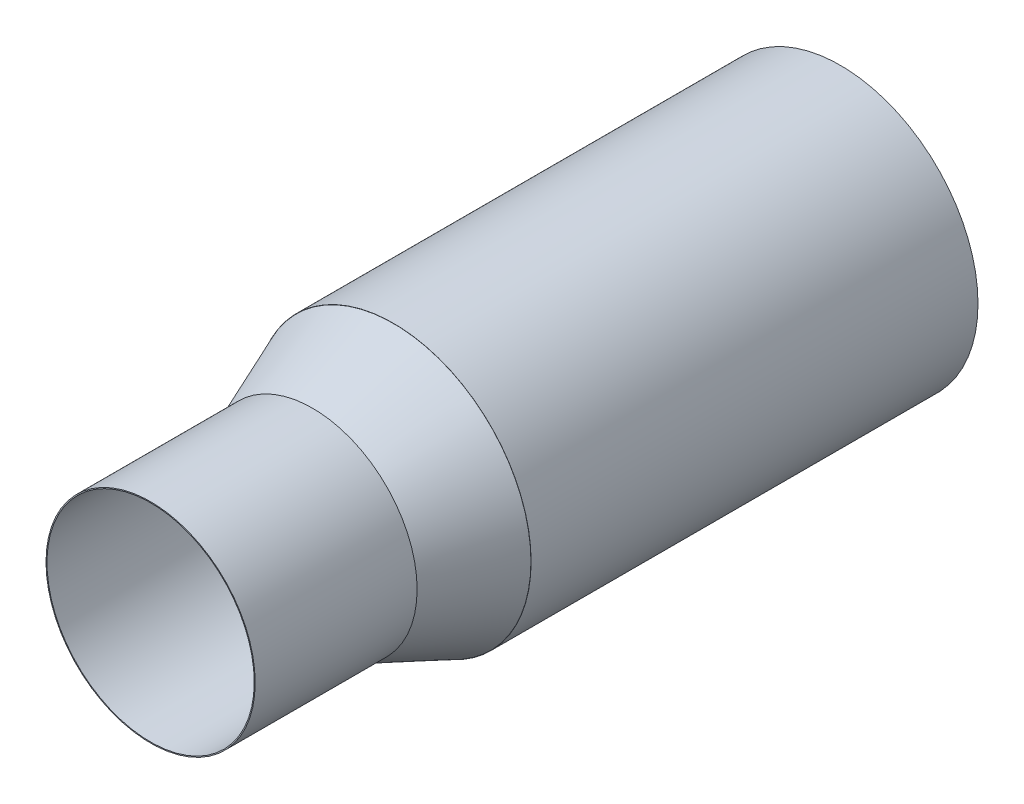
ISO-10303-21;
HEADER;
FILE_DESCRIPTION(('STEP AP214'),'2;1');
FILE_NAME('part.step','',(''),(''),'','','');
FILE_SCHEMA(('AUTOMOTIVE_DESIGN { 1 0 10303 214 1 1 1 1 }'));
ENDSEC;
DATA;
#1=APPLICATION_CONTEXT('core data for automotive mechanical design processes');
#2=APPLICATION_PROTOCOL_DEFINITION('international standard','automotive_design',2000,#1);
#3=PRODUCT_CONTEXT('',#1,'mechanical');
#4=PRODUCT('Part','Part','',(#3));
#5=PRODUCT_RELATED_PRODUCT_CATEGORY('part','',(#4));
#6=PRODUCT_DEFINITION_FORMATION('','',#4);
#7=PRODUCT_DEFINITION_CONTEXT('part definition',#1,'design');
#8=PRODUCT_DEFINITION('design','',#6,#7);
#9=PRODUCT_DEFINITION_SHAPE('','',#8);
#10=(LENGTH_UNIT() NAMED_UNIT(*) SI_UNIT(.MILLI.,.METRE.));
#11=(NAMED_UNIT(*) PLANE_ANGLE_UNIT() SI_UNIT($,.RADIAN.));
#12=(NAMED_UNIT(*) SI_UNIT($,.STERADIAN.) SOLID_ANGLE_UNIT());
#13=UNCERTAINTY_MEASURE_WITH_UNIT(LENGTH_MEASURE(1.E-05),#10,'distance_accuracy_value','');
#14=(GEOMETRIC_REPRESENTATION_CONTEXT(3) GLOBAL_UNCERTAINTY_ASSIGNED_CONTEXT((#13)) GLOBAL_UNIT_ASSIGNED_CONTEXT((#10,
#11,#12)) REPRESENTATION_CONTEXT('',''));
#15=CARTESIAN_POINT('',(0.,0.,0.));
#16=DIRECTION('',(0.,0.,1.));
#17=DIRECTION('',(1.,0.,0.));
#18=AXIS2_PLACEMENT_3D('',#15,#16,#17);
#19=CARTESIAN_POINT('',(0.,0.,108.2));
#20=DIRECTION('',(0.,0.,-1.));
#21=DIRECTION('',(-1.,0.,0.));
#22=AXIS2_PLACEMENT_3D('',#19,#20,#21);
#23=CYLINDRICAL_SURFACE('',#22,16.4084);
#24=CARTESIAN_POINT('',(0.,0.,108.2));
#25=DIRECTION('',(0.,0.,1.));
#26=DIRECTION('',(1.,0.,0.));
#27=AXIS2_PLACEMENT_3D('',#24,#25,#26);
#28=CIRCLE('',#27,16.4084);
#29=CARTESIAN_POINT('',(16.4084,0.,108.2));
#30=VERTEX_POINT('',#29);
#31=EDGE_CURVE('E96',#30,#30,#28,.T.);
#32=ORIENTED_EDGE('',*,*,#31,.F.);
#33=EDGE_LOOP('',(#32));
#34=FACE_BOUND('',#33,.T.);
#35=CARTESIAN_POINT('',(0.,0.,82.8));
#36=DIRECTION('',(0.,0.,-1.));
#37=DIRECTION('',(-1.,0.,0.));
#38=AXIS2_PLACEMENT_3D('',#35,#36,#37);
#39=CIRCLE('',#38,16.4084);
#40=CARTESIAN_POINT('',(-16.4084,0.,82.8));
#41=VERTEX_POINT('',#40);
#42=EDGE_CURVE('E11',#41,#41,#39,.T.);
#43=ORIENTED_EDGE('',*,*,#42,.F.);
#44=EDGE_LOOP('',(#43));
#45=FACE_BOUND('',#44,.T.);
#46=ADVANCED_FACE('F33',(#34,#45),#23,.T.);
#47=CARTESIAN_POINT('',(0.,0.,70.1));
#48=DIRECTION('',(0.,0.,1.));
#49=DIRECTION('',(1.,0.,0.));
#50=AXIS2_PLACEMENT_3D('',#47,#48,#49);
#51=PLANE('',#50);
#52=CARTESIAN_POINT('',(9.95557947936446,5.86947069419869,70.1));
#53=DIRECTION('',(0.,0.,1.));
#54=DIRECTION('',(1.,0.,0.));
#55=AXIS2_PLACEMENT_3D('',#52,#53,#54);
#56=CIRCLE('',#55,9.144);
#57=CARTESIAN_POINT('',(7.18292591962797,14.5829733330736,70.1));
#58=VERTEX_POINT('',#57);
#59=CARTESIAN_POINT('',(16.2375116890544,-0.775080736323875,70.1));
#60=VERTEX_POINT('',#59);
#61=EDGE_CURVE('E67',#58,#60,#56,.T.);
#62=ORIENTED_EDGE('',*,*,#61,.F.);
#63=CARTESIAN_POINT('',(0.,0.,70.1));
#64=DIRECTION('',(0.,0.,1.));
#65=DIRECTION('',(1.,0.,0.));
#66=AXIS2_PLACEMENT_3D('',#63,#64,#65);
#67=CIRCLE('',#66,16.256);
#68=CARTESIAN_POINT('',(-7.44751623688686,14.4496379851298,70.1));
#69=VERTEX_POINT('',#68);
#70=EDGE_CURVE('E54',#58,#69,#67,.T.);
#71=ORIENTED_EDGE('',*,*,#70,.T.);
#72=CARTESIAN_POINT('',(-10.0609004676266,5.68704939142529,70.1));
#73=DIRECTION('',(0.,0.,1.));
#74=DIRECTION('',(1.,0.,0.));
#75=AXIS2_PLACEMENT_3D('',#72,#73,#74);
#76=CIRCLE('',#75,9.144);
#77=CARTESIAN_POINT('',(-16.2206883289668,-1.07089034663737,70.1));
#78=VERTEX_POINT('',#77);
#79=EDGE_CURVE('E117',#78,#69,#76,.T.);
#80=ORIENTED_EDGE('',*,*,#79,.F.);
#81=CARTESIAN_POINT('',(-8.77414726783974,-13.6847314815549,70.1));
#82=VERTEX_POINT('',#81);
#83=EDGE_CURVE('E41',#78,#82,#67,.T.);
#84=ORIENTED_EDGE('',*,*,#83,.T.);
#85=CARTESIAN_POINT('',(0.118855303980422,-11.557,70.1));
#86=DIRECTION('',(0.,0.,1.));
#87=DIRECTION('',(1.,0.,0.));
#88=AXIS2_PLACEMENT_3D('',#85,#86,#87);
#89=CIRCLE('',#88,9.144);
#90=CARTESIAN_POINT('',(9.05373661670377,-13.5013847169599,70.1));
#91=VERTEX_POINT('',#90);
#92=EDGE_CURVE('E111',#91,#82,#89,.T.);
#93=ORIENTED_EDGE('',*,*,#92,.F.);
#94=EDGE_CURVE('E72',#91,#60,#67,.T.);
#95=ORIENTED_EDGE('',*,*,#94,.T.);
#96=EDGE_LOOP('',(#62,#71,#80,#84,#93,#95));
#97=FACE_BOUND('',#96,.T.);
#98=ADVANCED_FACE('F69',(#97),#51,.T.);
#99=CARTESIAN_POINT('',(0.,0.,70.1));
#100=DIRECTION('',(0.,0.,1.));
#101=DIRECTION('',(1.,0.,0.));
#102=AXIS2_PLACEMENT_3D('',#99,#100,#101);
#103=CIRCLE('',#102,21.5623465399517);
#104=CARTESIAN_POINT('',(21.5623465399517,0.,70.1));
#105=VERTEX_POINT('',#104);
#106=EDGE_CURVE('E87',#105,#105,#103,.T.);
#107=ORIENTED_EDGE('',*,*,#106,.F.);
#108=EDGE_LOOP('',(#107));
#109=FACE_BOUND('',#108,.T.);
#110=CARTESIAN_POINT('',(0.,0.,70.1));
#111=DIRECTION('',(0.,0.,1.));
#112=DIRECTION('',(1.,0.,0.));
#113=AXIS2_PLACEMENT_3D('',#110,#111,#112);
#114=CIRCLE('',#113,21.59);
#115=CARTESIAN_POINT('',(21.59,0.,70.1));
#116=VERTEX_POINT('',#115);
#117=EDGE_CURVE('E100',#116,#116,#114,.T.);
#118=ORIENTED_EDGE('',*,*,#117,.T.);
#119=EDGE_LOOP('',(#118));
#120=FACE_BOUND('',#119,.T.);
#121=ADVANCED_FACE('F144',(#109,#120),#51,.T.);
#122=CARTESIAN_POINT('',(0.,0.,0.));
#123=DIRECTION('',(0.,0.,1.));
#124=DIRECTION('',(1.,0.,0.));
#125=AXIS2_PLACEMENT_3D('',#122,#123,#124);
#126=PLANE('',#125);
#127=CARTESIAN_POINT('',(0.,0.,0.));
#128=DIRECTION('',(0.,0.,1.));
#129=DIRECTION('',(1.,0.,0.));
#130=AXIS2_PLACEMENT_3D('',#127,#128,#129);
#131=CIRCLE('',#130,21.59);
#132=CARTESIAN_POINT('',(21.59,0.,0.));
#133=VERTEX_POINT('',#132);
#134=EDGE_CURVE('E102',#133,#133,#131,.T.);
#135=ORIENTED_EDGE('',*,*,#134,.F.);
#136=EDGE_LOOP('',(#135));
#137=FACE_BOUND('',#136,.T.);
#138=CARTESIAN_POINT('',(0.118855303980422,-11.557,0.));
#139=DIRECTION('',(0.,0.,1.));
#140=DIRECTION('',(1.,0.,0.));
#141=AXIS2_PLACEMENT_3D('',#138,#139,#140);
#142=CIRCLE('',#141,9.144);
#143=CARTESIAN_POINT('',(9.26285530398042,-11.557,0.));
#144=VERTEX_POINT('',#143);
#145=EDGE_CURVE('E82',#144,#144,#142,.T.);
#146=ORIENTED_EDGE('',*,*,#145,.T.);
#147=EDGE_LOOP('',(#146));
#148=FACE_BOUND('',#147,.T.);
#149=CARTESIAN_POINT('',(9.95557947936446,5.86947069419869,0.));
#150=DIRECTION('',(0.,0.,1.));
#151=DIRECTION('',(1.,0.,0.));
#152=AXIS2_PLACEMENT_3D('',#149,#150,#151);
#153=CIRCLE('',#152,9.144);
#154=CARTESIAN_POINT('',(19.0995794793645,5.86947069419869,0.));
#155=VERTEX_POINT('',#154);
#156=EDGE_CURVE('E76',#155,#155,#153,.T.);
#157=ORIENTED_EDGE('',*,*,#156,.T.);
#158=EDGE_LOOP('',(#157));
#159=FACE_BOUND('',#158,.T.);
#160=CARTESIAN_POINT('',(-10.0609004676266,5.68704939142529,0.));
#161=DIRECTION('',(0.,0.,1.));
#162=DIRECTION('',(1.,0.,0.));
#163=AXIS2_PLACEMENT_3D('',#160,#161,#162);
#164=CIRCLE('',#163,9.144);
#165=CARTESIAN_POINT('',(-0.916900467626609,5.68704939142529,0.));
#166=VERTEX_POINT('',#165);
#167=EDGE_CURVE('E115',#166,#166,#164,.T.);
#168=ORIENTED_EDGE('',*,*,#167,.T.);
#169=EDGE_LOOP('',(#168));
#170=FACE_BOUND('',#169,.T.);
#171=ADVANCED_FACE('F160',(#137,#148,#159,#170),#126,.F.);
#172=CARTESIAN_POINT('',(0.,0.,70.1));
#173=DIRECTION('',(0.,0.,-1.));
#174=DIRECTION('',(-1.,0.,0.));
#175=AXIS2_PLACEMENT_3D('',#172,#173,#174);
#176=CYLINDRICAL_SURFACE('',#175,21.59);
#177=ORIENTED_EDGE('',*,*,#117,.F.);
#178=EDGE_LOOP('',(#177));
#179=FACE_BOUND('',#178,.T.);
#180=ORIENTED_EDGE('',*,*,#134,.T.);
#181=EDGE_LOOP('',(#180));
#182=FACE_BOUND('',#181,.T.);
#183=ADVANCED_FACE('F35',(#179,#182),#176,.T.);
#184=CARTESIAN_POINT('',(0.118855303980422,-11.557,70.1));
#185=DIRECTION('',(0.,0.,-1.));
#186=DIRECTION('',(-1.,0.,0.));
#187=AXIS2_PLACEMENT_3D('',#184,#185,#186);
#188=CYLINDRICAL_SURFACE('',#187,9.144);
#189=EDGE_CURVE('E107',#82,#91,#89,.T.);
#190=ORIENTED_EDGE('',*,*,#189,.T.);
#191=ORIENTED_EDGE('',*,*,#92,.T.);
#192=EDGE_LOOP('',(#190,#191));
#193=FACE_BOUND('',#192,.T.);
#194=ORIENTED_EDGE('',*,*,#145,.F.);
#195=EDGE_LOOP('',(#194));
#196=FACE_BOUND('',#195,.T.);
#197=ADVANCED_FACE('F156',(#193,#196),#188,.F.);
#198=CARTESIAN_POINT('',(9.95557947936446,5.86947069419869,70.1));
#199=DIRECTION('',(0.,0.,-1.));
#200=DIRECTION('',(-1.,0.,0.));
#201=AXIS2_PLACEMENT_3D('',#198,#199,#200);
#202=CYLINDRICAL_SURFACE('',#201,9.144);
#203=EDGE_CURVE('E75',#60,#58,#56,.T.);
#204=ORIENTED_EDGE('',*,*,#203,.T.);
#205=ORIENTED_EDGE('',*,*,#61,.T.);
#206=EDGE_LOOP('',(#204,#205));
#207=FACE_BOUND('',#206,.T.);
#208=ORIENTED_EDGE('',*,*,#156,.F.);
#209=EDGE_LOOP('',(#208));
#210=FACE_BOUND('',#209,.T.);
#211=ADVANCED_FACE('F79',(#207,#210),#202,.F.);
#212=CARTESIAN_POINT('',(-10.0609004676266,5.68704939142529,70.1));
#213=DIRECTION('',(0.,0.,-1.));
#214=DIRECTION('',(-1.,0.,0.));
#215=AXIS2_PLACEMENT_3D('',#212,#213,#214);
#216=CYLINDRICAL_SURFACE('',#215,9.144);
#217=EDGE_CURVE('E47',#69,#78,#76,.T.);
#218=ORIENTED_EDGE('',*,*,#217,.T.);
#219=ORIENTED_EDGE('',*,*,#79,.T.);
#220=EDGE_LOOP('',(#218,#219));
#221=FACE_BOUND('',#220,.T.);
#222=ORIENTED_EDGE('',*,*,#167,.F.);
#223=EDGE_LOOP('',(#222));
#224=FACE_BOUND('',#223,.T.);
#225=ADVANCED_FACE('F118',(#221,#224),#216,.F.);
#226=CARTESIAN_POINT('',(0.,0.,70.1));
#227=DIRECTION('',(0.,0.,1.));
#228=DIRECTION('',(1.,0.,0.));
#229=AXIS2_PLACEMENT_3D('',#226,#227,#228);
#230=PLANE('',#229);
#231=ORIENTED_EDGE('',*,*,#203,.F.);
#232=EDGE_CURVE('E83',#60,#58,#67,.T.);
#233=ORIENTED_EDGE('',*,*,#232,.T.);
#234=EDGE_LOOP('',(#231,#233));
#235=FACE_BOUND('',#234,.T.);
#236=ADVANCED_FACE('F84',(#235),#230,.F.);
#237=ORIENTED_EDGE('',*,*,#189,.F.);
#238=EDGE_CURVE('E86',#82,#91,#67,.T.);
#239=ORIENTED_EDGE('',*,*,#238,.T.);
#240=EDGE_LOOP('',(#237,#239));
#241=FACE_BOUND('',#240,.T.);
#242=ADVANCED_FACE('F126',(#241),#230,.F.);
#243=CARTESIAN_POINT('',(0.,0.,108.2));
#244=DIRECTION('',(0.,0.,-1.));
#245=DIRECTION('',(-1.,0.,0.));
#246=AXIS2_PLACEMENT_3D('',#243,#244,#245);
#247=CYLINDRICAL_SURFACE('',#246,16.256);
#248=CARTESIAN_POINT('',(0.,0.,108.2));
#249=DIRECTION('',(0.,0.,1.));
#250=DIRECTION('',(1.,0.,0.));
#251=AXIS2_PLACEMENT_3D('',#248,#249,#250);
#252=CIRCLE('',#251,16.256);
#253=CARTESIAN_POINT('',(16.256,0.,108.2));
#254=VERTEX_POINT('',#253);
#255=EDGE_CURVE('E94',#254,#254,#252,.T.);
#256=ORIENTED_EDGE('',*,*,#255,.T.);
#257=EDGE_LOOP('',(#256));
#258=FACE_BOUND('',#257,.T.);
#259=ORIENTED_EDGE('',*,*,#70,.F.);
#260=ORIENTED_EDGE('',*,*,#232,.F.);
#261=ORIENTED_EDGE('',*,*,#94,.F.);
#262=ORIENTED_EDGE('',*,*,#238,.F.);
#263=ORIENTED_EDGE('',*,*,#83,.F.);
#264=EDGE_CURVE('E93',#69,#78,#67,.T.);
#265=ORIENTED_EDGE('',*,*,#264,.F.);
#266=EDGE_LOOP('',(#259,#260,#261,#262,#263,#265));
#267=FACE_BOUND('',#266,.T.);
#268=ADVANCED_FACE('F90',(#258,#267),#247,.F.);
#269=CARTESIAN_POINT('',(0.,0.,108.2));
#270=DIRECTION('',(0.,0.,1.));
#271=DIRECTION('',(1.,0.,0.));
#272=AXIS2_PLACEMENT_3D('',#269,#270,#271);
#273=PLANE('',#272);
#274=ORIENTED_EDGE('',*,*,#255,.F.);
#275=EDGE_LOOP('',(#274));
#276=FACE_BOUND('',#275,.T.);
#277=ORIENTED_EDGE('',*,*,#31,.T.);
#278=EDGE_LOOP('',(#277));
#279=FACE_BOUND('',#278,.T.);
#280=ADVANCED_FACE('F124',(#276,#279),#273,.T.);
#281=ORIENTED_EDGE('',*,*,#217,.F.);
#282=ORIENTED_EDGE('',*,*,#264,.T.);
#283=EDGE_LOOP('',(#281,#282));
#284=FACE_BOUND('',#283,.T.);
#285=ADVANCED_FACE('F121',(#284),#230,.F.);
#286=CARTESIAN_POINT('',(0.,0.,70.1));
#287=DIRECTION('',(0.,0.,-1.));
#288=DIRECTION('',(-1.,0.,0.));
#289=AXIS2_PLACEMENT_3D('',#286,#287,#288);
#290=CONICAL_SURFACE('',#289,21.5623465399517,0.385515727626035);
#291=ORIENTED_EDGE('',*,*,#42,.T.);
#292=EDGE_LOOP('',(#291));
#293=FACE_BOUND('',#292,.T.);
#294=ORIENTED_EDGE('',*,*,#106,.T.);
#295=EDGE_LOOP('',(#294));
#296=FACE_BOUND('',#295,.T.);
#297=ADVANCED_FACE('F123',(#293,#296),#290,.T.);
#298=CLOSED_SHELL('',(#46,#98,#121,#171,#183,#197,#211,#225,#236,#242,#268,#280,#285,#297));
#299=MANIFOLD_SOLID_BREP('B2',#298);
#300=ADVANCED_BREP_SHAPE_REPRESENTATION('',(#18,#299),#14);
#301=SHAPE_DEFINITION_REPRESENTATION(#9,#300);
ENDSEC;
END-ISO-10303-21;
